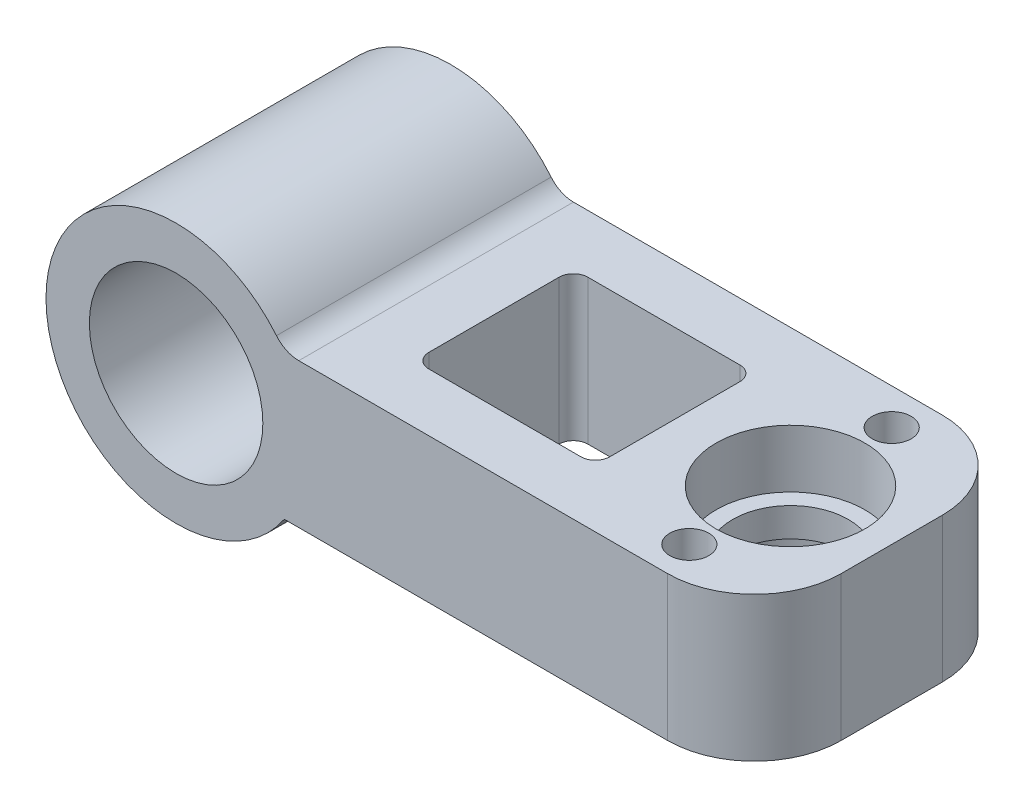
ISO-10303-21;
HEADER;
FILE_DESCRIPTION(('STEP AP214'),'2;1');
FILE_NAME('part.step','',(''),(''),'','','');
FILE_SCHEMA(('AUTOMOTIVE_DESIGN { 1 0 10303 214 1 1 1 1 }'));
ENDSEC;
DATA;
#1=APPLICATION_CONTEXT('core data for automotive mechanical design processes');
#2=APPLICATION_PROTOCOL_DEFINITION('international standard','automotive_design',2000,#1);
#3=PRODUCT_CONTEXT('',#1,'mechanical');
#4=PRODUCT('Part','Part','',(#3));
#5=PRODUCT_RELATED_PRODUCT_CATEGORY('part','',(#4));
#6=PRODUCT_DEFINITION_FORMATION('','',#4);
#7=PRODUCT_DEFINITION_CONTEXT('part definition',#1,'design');
#8=PRODUCT_DEFINITION('design','',#6,#7);
#9=PRODUCT_DEFINITION_SHAPE('','',#8);
#10=(LENGTH_UNIT() NAMED_UNIT(*) SI_UNIT(.MILLI.,.METRE.));
#11=(NAMED_UNIT(*) PLANE_ANGLE_UNIT() SI_UNIT($,.RADIAN.));
#12=(NAMED_UNIT(*) SI_UNIT($,.STERADIAN.) SOLID_ANGLE_UNIT());
#13=UNCERTAINTY_MEASURE_WITH_UNIT(LENGTH_MEASURE(1.E-05),#10,'distance_accuracy_value','');
#14=(GEOMETRIC_REPRESENTATION_CONTEXT(3) GLOBAL_UNCERTAINTY_ASSIGNED_CONTEXT((#13)) GLOBAL_UNIT_ASSIGNED_CONTEXT((#10,
#11,#12)) REPRESENTATION_CONTEXT('',''));
#15=CARTESIAN_POINT('',(0.,0.,0.));
#16=DIRECTION('',(0.,0.,1.));
#17=DIRECTION('',(1.,0.,0.));
#18=AXIS2_PLACEMENT_3D('',#15,#16,#17);
#19=CARTESIAN_POINT('',(33.,5.,0.));
#20=DIRECTION('',(0.,-1.,0.));
#21=DIRECTION('',(0.,0.,-1.));
#22=AXIS2_PLACEMENT_3D('',#19,#20,#21);
#23=CYLINDRICAL_SURFACE('',#22,4.);
#24=CARTESIAN_POINT('',(33.,1.,0.));
#25=DIRECTION('',(0.,1.,0.));
#26=DIRECTION('',(0.,0.,1.));
#27=AXIS2_PLACEMENT_3D('',#24,#25,#26);
#28=CIRCLE('',#27,4.);
#29=CARTESIAN_POINT('',(33.,1.,4.));
#30=VERTEX_POINT('',#29);
#31=EDGE_CURVE('E185',#30,#30,#28,.T.);
#32=ORIENTED_EDGE('',*,*,#31,.T.);
#33=EDGE_LOOP('',(#32));
#34=FACE_BOUND('',#33,.T.);
#35=CARTESIAN_POINT('',(33.,-1.,0.));
#36=DIRECTION('',(0.,-1.,0.));
#37=DIRECTION('',(0.,0.,-1.));
#38=AXIS2_PLACEMENT_3D('',#35,#36,#37);
#39=CIRCLE('',#38,4.);
#40=CARTESIAN_POINT('',(33.,-1.,-4.));
#41=VERTEX_POINT('',#40);
#42=EDGE_CURVE('E198',#41,#41,#39,.T.);
#43=ORIENTED_EDGE('',*,*,#42,.T.);
#44=EDGE_LOOP('',(#43));
#45=FACE_BOUND('',#44,.T.);
#46=ADVANCED_FACE('F33',(#34,#45),#23,.F.);
#47=CARTESIAN_POINT('',(0.,0.,9.5));
#48=DIRECTION('',(0.,0.,1.));
#49=DIRECTION('',(1.,0.,0.));
#50=AXIS2_PLACEMENT_3D('',#47,#48,#49);
#51=PLANE('',#50);
#52=CARTESIAN_POINT('',(0.,0.,9.5));
#53=DIRECTION('',(0.,0.,1.));
#54=DIRECTION('',(1.,0.,0.));
#55=AXIS2_PLACEMENT_3D('',#52,#53,#54);
#56=CIRCLE('',#55,6.);
#57=CARTESIAN_POINT('',(6.,0.,9.5));
#58=VERTEX_POINT('',#57);
#59=EDGE_CURVE('E179',#58,#58,#56,.T.);
#60=ORIENTED_EDGE('',*,*,#59,.F.);
#61=EDGE_LOOP('',(#60));
#62=FACE_BOUND('',#61,.T.);
#63=DIRECTION('',(1.,0.,0.));
#64=VECTOR('',#63,1.);
#65=CARTESIAN_POINT('',(0.,-5.,9.5));
#66=LINE('',#65,#64);
#67=CARTESIAN_POINT('',(7.48331477354788,-5.,9.5));
#68=VERTEX_POINT('',#67);
#69=CARTESIAN_POINT('',(34.,-5.,9.5));
#70=VERTEX_POINT('',#69);
#71=EDGE_CURVE('E144',#68,#70,#66,.T.);
#72=ORIENTED_EDGE('',*,*,#71,.T.);
#73=DIRECTION('',(0.,-1.,0.));
#74=VECTOR('',#73,1.);
#75=CARTESIAN_POINT('',(34.,5.,9.5));
#76=LINE('',#75,#74);
#77=CARTESIAN_POINT('',(34.,5.,9.5));
#78=VERTEX_POINT('',#77);
#79=EDGE_CURVE('E11',#70,#78,#76,.F.);
#80=ORIENTED_EDGE('',*,*,#79,.T.);
#81=DIRECTION('',(1.,0.,0.));
#82=VECTOR('',#81,1.);
#83=CARTESIAN_POINT('',(0.,5.,9.5));
#84=LINE('',#83,#82);
#85=CARTESIAN_POINT('',(8.48528137423857,5.,9.5));
#86=VERTEX_POINT('',#85);
#87=EDGE_CURVE('E177',#86,#78,#84,.T.);
#88=ORIENTED_EDGE('',*,*,#87,.F.);
#89=CARTESIAN_POINT('',(8.48528137423857,7.,9.5));
#90=DIRECTION('',(0.,0.,1.));
#91=DIRECTION('',(1.,0.,0.));
#92=AXIS2_PLACEMENT_3D('',#89,#90,#91);
#93=CIRCLE('',#92,2.);
#94=CARTESIAN_POINT('',(6.94250294255883,5.72727272727273,9.5));
#95=VERTEX_POINT('',#94);
#96=EDGE_CURVE('E146',#86,#95,#93,.F.);
#97=ORIENTED_EDGE('',*,*,#96,.T.);
#98=CARTESIAN_POINT('',(0.,0.,9.5));
#99=DIRECTION('',(0.,0.,1.));
#100=DIRECTION('',(1.,0.,0.));
#101=AXIS2_PLACEMENT_3D('',#98,#99,#100);
#102=CIRCLE('',#101,9.);
#103=EDGE_CURVE('E140',#95,#68,#102,.T.);
#104=ORIENTED_EDGE('',*,*,#103,.T.);
#105=EDGE_LOOP('',(#72,#80,#88,#97,#104));
#106=FACE_BOUND('',#105,.T.);
#107=ADVANCED_FACE('F142',(#62,#106),#51,.T.);
#108=CARTESIAN_POINT('',(0.,0.,-9.5));
#109=DIRECTION('',(0.,0.,1.));
#110=DIRECTION('',(1.,0.,0.));
#111=AXIS2_PLACEMENT_3D('',#108,#109,#110);
#112=PLANE('',#111);
#113=CARTESIAN_POINT('',(0.,0.,-9.5));
#114=DIRECTION('',(0.,0.,1.));
#115=DIRECTION('',(1.,0.,0.));
#116=AXIS2_PLACEMENT_3D('',#113,#114,#115);
#117=CIRCLE('',#116,6.);
#118=CARTESIAN_POINT('',(6.,0.,-9.5));
#119=VERTEX_POINT('',#118);
#120=EDGE_CURVE('E160',#119,#119,#117,.T.);
#121=ORIENTED_EDGE('',*,*,#120,.T.);
#122=EDGE_LOOP('',(#121));
#123=FACE_BOUND('',#122,.T.);
#124=DIRECTION('',(-1.,0.,0.));
#125=VECTOR('',#124,1.);
#126=CARTESIAN_POINT('',(0.,5.,-9.5));
#127=LINE('',#126,#125);
#128=CARTESIAN_POINT('',(34.,5.,-9.5));
#129=VERTEX_POINT('',#128);
#130=CARTESIAN_POINT('',(8.48528137423857,5.,-9.5));
#131=VERTEX_POINT('',#130);
#132=EDGE_CURVE('E161',#129,#131,#127,.T.);
#133=ORIENTED_EDGE('',*,*,#132,.F.);
#134=DIRECTION('',(0.,-1.,0.));
#135=VECTOR('',#134,1.);
#136=CARTESIAN_POINT('',(34.,0.,-9.5));
#137=LINE('',#136,#135);
#138=CARTESIAN_POINT('',(34.,-5.,-9.5));
#139=VERTEX_POINT('',#138);
#140=EDGE_CURVE('E250',#129,#139,#137,.T.);
#141=ORIENTED_EDGE('',*,*,#140,.T.);
#142=DIRECTION('',(-1.,0.,0.));
#143=VECTOR('',#142,1.);
#144=CARTESIAN_POINT('',(0.,-5.,-9.5));
#145=LINE('',#144,#143);
#146=CARTESIAN_POINT('',(7.48331477354788,-5.,-9.5));
#147=VERTEX_POINT('',#146);
#148=EDGE_CURVE('E169',#139,#147,#145,.T.);
#149=ORIENTED_EDGE('',*,*,#148,.T.);
#150=CARTESIAN_POINT('',(0.,0.,-9.5));
#151=DIRECTION('',(0.,0.,1.));
#152=DIRECTION('',(1.,0.,0.));
#153=AXIS2_PLACEMENT_3D('',#150,#151,#152);
#154=CIRCLE('',#153,9.);
#155=CARTESIAN_POINT('',(6.94250294255883,5.72727272727273,-9.5));
#156=VERTEX_POINT('',#155);
#157=EDGE_CURVE('E151',#156,#147,#154,.T.);
#158=ORIENTED_EDGE('',*,*,#157,.F.);
#159=CARTESIAN_POINT('',(8.48528137423857,7.,-9.5));
#160=DIRECTION('',(0.,0.,1.));
#161=DIRECTION('',(1.,0.,0.));
#162=AXIS2_PLACEMENT_3D('',#159,#160,#161);
#163=CIRCLE('',#162,2.);
#164=EDGE_CURVE('E193',#156,#131,#163,.T.);
#165=ORIENTED_EDGE('',*,*,#164,.T.);
#166=EDGE_LOOP('',(#133,#141,#149,#158,#165));
#167=FACE_BOUND('',#166,.T.);
#168=ADVANCED_FACE('F269',(#123,#167),#112,.F.);
#169=CARTESIAN_POINT('',(0.,0.,9.5));
#170=DIRECTION('',(0.,0.,-1.));
#171=DIRECTION('',(-1.,0.,0.));
#172=AXIS2_PLACEMENT_3D('',#169,#170,#171);
#173=CYLINDRICAL_SURFACE('',#172,9.);
#174=ORIENTED_EDGE('',*,*,#103,.F.);
#175=DIRECTION('',(0.,0.,-1.));
#176=VECTOR('',#175,1.);
#177=CARTESIAN_POINT('',(6.94250294255883,5.72727272727273,9.5));
#178=LINE('',#177,#176);
#179=EDGE_CURVE('E150',#95,#156,#178,.T.);
#180=ORIENTED_EDGE('',*,*,#179,.T.);
#181=ORIENTED_EDGE('',*,*,#157,.T.);
#182=DIRECTION('',(0.,0.,-1.));
#183=VECTOR('',#182,1.);
#184=CARTESIAN_POINT('',(7.48331477354788,-5.,9.5));
#185=LINE('',#184,#183);
#186=EDGE_CURVE('E155',#68,#147,#185,.T.);
#187=ORIENTED_EDGE('',*,*,#186,.F.);
#188=EDGE_LOOP('',(#174,#180,#181,#187));
#189=FACE_BOUND('',#188,.T.);
#190=ADVANCED_FACE('F156',(#189),#173,.T.);
#191=CARTESIAN_POINT('',(0.,0.,9.5));
#192=DIRECTION('',(0.,0.,-1.));
#193=DIRECTION('',(-1.,0.,0.));
#194=AXIS2_PLACEMENT_3D('',#191,#192,#193);
#195=CYLINDRICAL_SURFACE('',#194,6.);
#196=ORIENTED_EDGE('',*,*,#120,.F.);
#197=EDGE_LOOP('',(#196));
#198=FACE_BOUND('',#197,.T.);
#199=ORIENTED_EDGE('',*,*,#59,.T.);
#200=EDGE_LOOP('',(#199));
#201=FACE_BOUND('',#200,.T.);
#202=ADVANCED_FACE('F346',(#198,#201),#195,.F.);
#203=CARTESIAN_POINT('',(0.,5.,0.));
#204=DIRECTION('',(0.,1.,0.));
#205=DIRECTION('',(0.,0.,1.));
#206=AXIS2_PLACEMENT_3D('',#203,#204,#205);
#207=PLANE('',#206);
#208=DIRECTION('',(0.,0.,1.));
#209=VECTOR('',#208,1.);
#210=CARTESIAN_POINT('',(12.4852813742386,5.,-5.5));
#211=LINE('',#210,#209);
#212=CARTESIAN_POINT('',(12.4852813742386,5.,-4.5));
#213=VERTEX_POINT('',#212);
#214=CARTESIAN_POINT('',(12.4852813742386,5.,4.5));
#215=VERTEX_POINT('',#214);
#216=EDGE_CURVE('E303',#213,#215,#211,.T.);
#217=ORIENTED_EDGE('',*,*,#216,.F.);
#218=CARTESIAN_POINT('',(13.4852813742386,5.,-4.5));
#219=DIRECTION('',(0.,1.,0.));
#220=DIRECTION('',(0.,0.,1.));
#221=AXIS2_PLACEMENT_3D('',#218,#219,#220);
#222=CIRCLE('',#221,1.);
#223=CARTESIAN_POINT('',(13.4852813742386,5.,-5.5));
#224=VERTEX_POINT('',#223);
#225=EDGE_CURVE('E246',#213,#224,#222,.F.);
#226=ORIENTED_EDGE('',*,*,#225,.T.);
#227=DIRECTION('',(-1.,0.,0.));
#228=VECTOR('',#227,1.);
#229=CARTESIAN_POINT('',(12.4852813742386,5.,-5.5));
#230=LINE('',#229,#228);
#231=CARTESIAN_POINT('',(24.,5.,-5.5));
#232=VERTEX_POINT('',#231);
#233=EDGE_CURVE('E292',#232,#224,#230,.T.);
#234=ORIENTED_EDGE('',*,*,#233,.F.);
#235=CARTESIAN_POINT('',(24.,5.,-4.5));
#236=DIRECTION('',(0.,1.,0.));
#237=DIRECTION('',(0.,0.,1.));
#238=AXIS2_PLACEMENT_3D('',#235,#236,#237);
#239=CIRCLE('',#238,1.);
#240=CARTESIAN_POINT('',(25.,5.,-4.5));
#241=VERTEX_POINT('',#240);
#242=EDGE_CURVE('E242',#232,#241,#239,.F.);
#243=ORIENTED_EDGE('',*,*,#242,.T.);
#244=DIRECTION('',(0.,0.,-1.));
#245=VECTOR('',#244,1.);
#246=CARTESIAN_POINT('',(25.,5.,-5.5));
#247=LINE('',#246,#245);
#248=CARTESIAN_POINT('',(25.,5.,4.5));
#249=VERTEX_POINT('',#248);
#250=EDGE_CURVE('E297',#249,#241,#247,.T.);
#251=ORIENTED_EDGE('',*,*,#250,.F.);
#252=CARTESIAN_POINT('',(24.,5.,4.5));
#253=DIRECTION('',(0.,1.,0.));
#254=DIRECTION('',(0.,0.,1.));
#255=AXIS2_PLACEMENT_3D('',#252,#253,#254);
#256=CIRCLE('',#255,1.);
#257=CARTESIAN_POINT('',(24.,5.,5.5));
#258=VERTEX_POINT('',#257);
#259=EDGE_CURVE('E234',#249,#258,#256,.F.);
#260=ORIENTED_EDGE('',*,*,#259,.T.);
#261=DIRECTION('',(1.,0.,0.));
#262=VECTOR('',#261,1.);
#263=CARTESIAN_POINT('',(12.4852813742386,5.,5.5));
#264=LINE('',#263,#262);
#265=CARTESIAN_POINT('',(13.4852813742386,5.,5.5));
#266=VERTEX_POINT('',#265);
#267=EDGE_CURVE('E300',#266,#258,#264,.T.);
#268=ORIENTED_EDGE('',*,*,#267,.F.);
#269=CARTESIAN_POINT('',(13.4852813742386,5.,4.5));
#270=DIRECTION('',(0.,1.,0.));
#271=DIRECTION('',(0.,0.,1.));
#272=AXIS2_PLACEMENT_3D('',#269,#270,#271);
#273=CIRCLE('',#272,1.);
#274=EDGE_CURVE('E238',#266,#215,#273,.F.);
#275=ORIENTED_EDGE('',*,*,#274,.T.);
#276=EDGE_LOOP('',(#217,#226,#234,#243,#251,#260,#268,#275));
#277=FACE_BOUND('',#276,.T.);
#278=CARTESIAN_POINT('',(33.,5.,0.));
#279=DIRECTION('',(0.,1.,0.));
#280=DIRECTION('',(0.,0.,1.));
#281=AXIS2_PLACEMENT_3D('',#278,#279,#280);
#282=CIRCLE('',#281,5.15);
#283=CARTESIAN_POINT('',(33.,5.,5.15));
#284=VERTEX_POINT('',#283);
#285=EDGE_CURVE('E201',#284,#284,#282,.T.);
#286=ORIENTED_EDGE('',*,*,#285,.F.);
#287=EDGE_LOOP('',(#286));
#288=FACE_BOUND('',#287,.T.);
#289=CARTESIAN_POINT('',(33.,5.,7.));
#290=DIRECTION('',(0.,1.,0.));
#291=DIRECTION('',(0.,0.,1.));
#292=AXIS2_PLACEMENT_3D('',#289,#290,#291);
#293=CIRCLE('',#292,1.35);
#294=CARTESIAN_POINT('',(33.,5.,8.35));
#295=VERTEX_POINT('',#294);
#296=EDGE_CURVE('E167',#295,#295,#293,.T.);
#297=ORIENTED_EDGE('',*,*,#296,.F.);
#298=EDGE_LOOP('',(#297));
#299=FACE_BOUND('',#298,.T.);
#300=CARTESIAN_POINT('',(33.,5.,-7.));
#301=DIRECTION('',(0.,1.,0.));
#302=DIRECTION('',(0.,0.,1.));
#303=AXIS2_PLACEMENT_3D('',#300,#301,#302);
#304=CIRCLE('',#303,1.35);
#305=CARTESIAN_POINT('',(33.,5.,-5.65));
#306=VERTEX_POINT('',#305);
#307=EDGE_CURVE('E279',#306,#306,#304,.T.);
#308=ORIENTED_EDGE('',*,*,#307,.F.);
#309=EDGE_LOOP('',(#308));
#310=FACE_BOUND('',#309,.T.);
#311=DIRECTION('',(0.,0.,-1.));
#312=VECTOR('',#311,1.);
#313=CARTESIAN_POINT('',(40.,5.,-9.5));
#314=LINE('',#313,#312);
#315=CARTESIAN_POINT('',(40.,5.,3.5));
#316=VERTEX_POINT('',#315);
#317=CARTESIAN_POINT('',(40.,5.,-3.5));
#318=VERTEX_POINT('',#317);
#319=EDGE_CURVE('E265',#316,#318,#314,.T.);
#320=ORIENTED_EDGE('',*,*,#319,.T.);
#321=CARTESIAN_POINT('',(34.,5.,-3.5));
#322=DIRECTION('',(0.,1.,0.));
#323=DIRECTION('',(0.,0.,1.));
#324=AXIS2_PLACEMENT_3D('',#321,#322,#323);
#325=CIRCLE('',#324,6.);
#326=EDGE_CURVE('E41',#318,#129,#325,.T.);
#327=ORIENTED_EDGE('',*,*,#326,.T.);
#328=ORIENTED_EDGE('',*,*,#132,.T.);
#329=DIRECTION('',(0.,0.,-1.));
#330=VECTOR('',#329,1.);
#331=CARTESIAN_POINT('',(8.48528137423857,5.,0.));
#332=LINE('',#331,#330);
#333=EDGE_CURVE('E191',#131,#86,#332,.F.);
#334=ORIENTED_EDGE('',*,*,#333,.T.);
#335=ORIENTED_EDGE('',*,*,#87,.T.);
#336=CARTESIAN_POINT('',(34.,5.,3.5));
#337=DIRECTION('',(0.,1.,0.));
#338=DIRECTION('',(0.,0.,1.));
#339=AXIS2_PLACEMENT_3D('',#336,#337,#338);
#340=CIRCLE('',#339,6.);
#341=EDGE_CURVE('E260',#78,#316,#340,.T.);
#342=ORIENTED_EDGE('',*,*,#341,.T.);
#343=EDGE_LOOP('',(#320,#327,#328,#334,#335,#342));
#344=FACE_BOUND('',#343,.T.);
#345=ADVANCED_FACE('F264',(#277,#288,#299,#310,#344),#207,.T.);
#346=CARTESIAN_POINT('',(0.,-5.,0.));
#347=DIRECTION('',(0.,1.,0.));
#348=DIRECTION('',(0.,0.,1.));
#349=AXIS2_PLACEMENT_3D('',#346,#347,#348);
#350=PLANE('',#349);
#351=DIRECTION('',(0.,0.,-1.));
#352=VECTOR('',#351,1.);
#353=CARTESIAN_POINT('',(25.,-5.,0.));
#354=LINE('',#353,#352);
#355=CARTESIAN_POINT('',(25.,-5.,4.5));
#356=VERTEX_POINT('',#355);
#357=CARTESIAN_POINT('',(25.,-5.,-4.5));
#358=VERTEX_POINT('',#357);
#359=EDGE_CURVE('E205',#356,#358,#354,.T.);
#360=ORIENTED_EDGE('',*,*,#359,.T.);
#361=CARTESIAN_POINT('',(24.,-5.,-4.5));
#362=DIRECTION('',(0.,1.,0.));
#363=DIRECTION('',(0.,0.,1.));
#364=AXIS2_PLACEMENT_3D('',#361,#362,#363);
#365=CIRCLE('',#364,1.);
#366=CARTESIAN_POINT('',(24.,-5.,-5.5));
#367=VERTEX_POINT('',#366);
#368=EDGE_CURVE('E244',#358,#367,#365,.T.);
#369=ORIENTED_EDGE('',*,*,#368,.T.);
#370=DIRECTION('',(-1.,0.,0.));
#371=VECTOR('',#370,1.);
#372=CARTESIAN_POINT('',(0.,-5.,-5.5));
#373=LINE('',#372,#371);
#374=CARTESIAN_POINT('',(13.4852813742386,-5.,-5.5));
#375=VERTEX_POINT('',#374);
#376=EDGE_CURVE('E208',#367,#375,#373,.T.);
#377=ORIENTED_EDGE('',*,*,#376,.T.);
#378=CARTESIAN_POINT('',(13.4852813742386,-5.,-4.5));
#379=DIRECTION('',(0.,1.,0.));
#380=DIRECTION('',(0.,0.,1.));
#381=AXIS2_PLACEMENT_3D('',#378,#379,#380);
#382=CIRCLE('',#381,1.);
#383=CARTESIAN_POINT('',(12.4852813742386,-5.,-4.5));
#384=VERTEX_POINT('',#383);
#385=EDGE_CURVE('E248',#375,#384,#382,.T.);
#386=ORIENTED_EDGE('',*,*,#385,.T.);
#387=DIRECTION('',(0.,0.,1.));
#388=VECTOR('',#387,1.);
#389=CARTESIAN_POINT('',(12.4852813742386,-5.,0.));
#390=LINE('',#389,#388);
#391=CARTESIAN_POINT('',(12.4852813742386,-5.,4.5));
#392=VERTEX_POINT('',#391);
#393=EDGE_CURVE('E211',#384,#392,#390,.T.);
#394=ORIENTED_EDGE('',*,*,#393,.T.);
#395=CARTESIAN_POINT('',(13.4852813742386,-5.,4.5));
#396=DIRECTION('',(0.,1.,0.));
#397=DIRECTION('',(0.,0.,1.));
#398=AXIS2_PLACEMENT_3D('',#395,#396,#397);
#399=CIRCLE('',#398,1.);
#400=CARTESIAN_POINT('',(13.4852813742386,-5.,5.5));
#401=VERTEX_POINT('',#400);
#402=EDGE_CURVE('E240',#392,#401,#399,.T.);
#403=ORIENTED_EDGE('',*,*,#402,.T.);
#404=DIRECTION('',(1.,0.,0.));
#405=VECTOR('',#404,1.);
#406=CARTESIAN_POINT('',(0.,-5.,5.5));
#407=LINE('',#406,#405);
#408=CARTESIAN_POINT('',(24.,-5.,5.5));
#409=VERTEX_POINT('',#408);
#410=EDGE_CURVE('E197',#401,#409,#407,.T.);
#411=ORIENTED_EDGE('',*,*,#410,.T.);
#412=CARTESIAN_POINT('',(24.,-5.,4.5));
#413=DIRECTION('',(0.,1.,0.));
#414=DIRECTION('',(0.,0.,1.));
#415=AXIS2_PLACEMENT_3D('',#412,#413,#414);
#416=CIRCLE('',#415,1.);
#417=EDGE_CURVE('E236',#409,#356,#416,.T.);
#418=ORIENTED_EDGE('',*,*,#417,.T.);
#419=EDGE_LOOP('',(#360,#369,#377,#386,#394,#403,#411,#418));
#420=FACE_BOUND('',#419,.T.);
#421=CARTESIAN_POINT('',(33.,-5.,0.));
#422=DIRECTION('',(0.,1.,0.));
#423=DIRECTION('',(0.,0.,1.));
#424=AXIS2_PLACEMENT_3D('',#421,#422,#423);
#425=CIRCLE('',#424,5.15);
#426=CARTESIAN_POINT('',(33.,-5.,5.15));
#427=VERTEX_POINT('',#426);
#428=EDGE_CURVE('E289',#427,#427,#425,.T.);
#429=ORIENTED_EDGE('',*,*,#428,.T.);
#430=EDGE_LOOP('',(#429));
#431=FACE_BOUND('',#430,.T.);
#432=CARTESIAN_POINT('',(33.,-5.,7.));
#433=DIRECTION('',(0.,1.,0.));
#434=DIRECTION('',(0.,0.,1.));
#435=AXIS2_PLACEMENT_3D('',#432,#433,#434);
#436=CIRCLE('',#435,1.35);
#437=CARTESIAN_POINT('',(33.,-5.,8.35));
#438=VERTEX_POINT('',#437);
#439=EDGE_CURVE('E172',#438,#438,#436,.T.);
#440=ORIENTED_EDGE('',*,*,#439,.T.);
#441=EDGE_LOOP('',(#440));
#442=FACE_BOUND('',#441,.T.);
#443=CARTESIAN_POINT('',(33.,-5.,-7.));
#444=DIRECTION('',(0.,1.,0.));
#445=DIRECTION('',(0.,0.,1.));
#446=AXIS2_PLACEMENT_3D('',#443,#444,#445);
#447=CIRCLE('',#446,1.35);
#448=CARTESIAN_POINT('',(33.,-5.,-5.65));
#449=VERTEX_POINT('',#448);
#450=EDGE_CURVE('E188',#449,#449,#447,.T.);
#451=ORIENTED_EDGE('',*,*,#450,.T.);
#452=EDGE_LOOP('',(#451));
#453=FACE_BOUND('',#452,.T.);
#454=ORIENTED_EDGE('',*,*,#148,.F.);
#455=CARTESIAN_POINT('',(34.,-5.,-3.5));
#456=DIRECTION('',(0.,1.,0.));
#457=DIRECTION('',(0.,0.,1.));
#458=AXIS2_PLACEMENT_3D('',#455,#456,#457);
#459=CIRCLE('',#458,6.);
#460=CARTESIAN_POINT('',(40.,-5.,-3.5));
#461=VERTEX_POINT('',#460);
#462=EDGE_CURVE('E254',#139,#461,#459,.F.);
#463=ORIENTED_EDGE('',*,*,#462,.T.);
#464=DIRECTION('',(0.,0.,-1.));
#465=VECTOR('',#464,1.);
#466=CARTESIAN_POINT('',(40.,-5.,-9.5));
#467=LINE('',#466,#465);
#468=CARTESIAN_POINT('',(40.,-5.,3.5));
#469=VERTEX_POINT('',#468);
#470=EDGE_CURVE('E166',#469,#461,#467,.T.);
#471=ORIENTED_EDGE('',*,*,#470,.F.);
#472=CARTESIAN_POINT('',(34.,-5.,3.5));
#473=DIRECTION('',(0.,1.,0.));
#474=DIRECTION('',(0.,0.,1.));
#475=AXIS2_PLACEMENT_3D('',#472,#473,#474);
#476=CIRCLE('',#475,6.);
#477=EDGE_CURVE('E165',#469,#70,#476,.F.);
#478=ORIENTED_EDGE('',*,*,#477,.T.);
#479=ORIENTED_EDGE('',*,*,#71,.F.);
#480=ORIENTED_EDGE('',*,*,#186,.T.);
#481=EDGE_LOOP('',(#454,#463,#471,#478,#479,#480));
#482=FACE_BOUND('',#481,.T.);
#483=ADVANCED_FACE('F163',(#420,#431,#442,#453,#482),#350,.F.);
#484=CARTESIAN_POINT('',(40.,5.,-9.5));
#485=DIRECTION('',(-1.,0.,0.));
#486=DIRECTION('',(0.,0.,1.));
#487=AXIS2_PLACEMENT_3D('',#484,#485,#486);
#488=PLANE('',#487);
#489=ORIENTED_EDGE('',*,*,#470,.T.);
#490=DIRECTION('',(0.,-1.,0.));
#491=VECTOR('',#490,1.);
#492=CARTESIAN_POINT('',(40.,5.,-3.5));
#493=LINE('',#492,#491);
#494=EDGE_CURVE('E54',#461,#318,#493,.F.);
#495=ORIENTED_EDGE('',*,*,#494,.T.);
#496=ORIENTED_EDGE('',*,*,#319,.F.);
#497=DIRECTION('',(0.,-1.,0.));
#498=VECTOR('',#497,1.);
#499=CARTESIAN_POINT('',(40.,-5.,3.5));
#500=LINE('',#499,#498);
#501=EDGE_CURVE('E256',#316,#469,#500,.T.);
#502=ORIENTED_EDGE('',*,*,#501,.T.);
#503=EDGE_LOOP('',(#489,#495,#496,#502));
#504=FACE_BOUND('',#503,.T.);
#505=ADVANCED_FACE('F272',(#504),#488,.F.);
#506=CARTESIAN_POINT('',(33.,5.,7.));
#507=DIRECTION('',(0.,-1.,0.));
#508=DIRECTION('',(0.,0.,-1.));
#509=AXIS2_PLACEMENT_3D('',#506,#507,#508);
#510=CYLINDRICAL_SURFACE('',#509,1.35);
#511=ORIENTED_EDGE('',*,*,#296,.T.);
#512=EDGE_LOOP('',(#511));
#513=FACE_BOUND('',#512,.T.);
#514=ORIENTED_EDGE('',*,*,#439,.F.);
#515=EDGE_LOOP('',(#514));
#516=FACE_BOUND('',#515,.T.);
#517=ADVANCED_FACE('F358',(#513,#516),#510,.F.);
#518=CARTESIAN_POINT('',(33.,5.,-7.));
#519=DIRECTION('',(0.,-1.,0.));
#520=DIRECTION('',(0.,0.,-1.));
#521=AXIS2_PLACEMENT_3D('',#518,#519,#520);
#522=CYLINDRICAL_SURFACE('',#521,1.35);
#523=ORIENTED_EDGE('',*,*,#307,.T.);
#524=EDGE_LOOP('',(#523));
#525=FACE_BOUND('',#524,.T.);
#526=ORIENTED_EDGE('',*,*,#450,.F.);
#527=EDGE_LOOP('',(#526));
#528=FACE_BOUND('',#527,.T.);
#529=ADVANCED_FACE('F354',(#525,#528),#522,.F.);
#530=CARTESIAN_POINT('',(33.,1.,0.));
#531=DIRECTION('',(0.,1.,0.));
#532=DIRECTION('',(0.,0.,1.));
#533=AXIS2_PLACEMENT_3D('',#530,#531,#532);
#534=CYLINDRICAL_SURFACE('',#533,5.15);
#535=CARTESIAN_POINT('',(33.,1.,0.));
#536=DIRECTION('',(0.,1.,0.));
#537=DIRECTION('',(0.,0.,1.));
#538=AXIS2_PLACEMENT_3D('',#535,#536,#537);
#539=CIRCLE('',#538,5.15);
#540=CARTESIAN_POINT('',(33.,1.,5.15));
#541=VERTEX_POINT('',#540);
#542=EDGE_CURVE('E189',#541,#541,#539,.T.);
#543=ORIENTED_EDGE('',*,*,#542,.F.);
#544=EDGE_LOOP('',(#543));
#545=FACE_BOUND('',#544,.T.);
#546=ORIENTED_EDGE('',*,*,#285,.T.);
#547=EDGE_LOOP('',(#546));
#548=FACE_BOUND('',#547,.T.);
#549=ADVANCED_FACE('F357',(#545,#548),#534,.F.);
#550=CARTESIAN_POINT('',(33.,1.,0.));
#551=DIRECTION('',(0.,1.,0.));
#552=DIRECTION('',(0.,0.,1.));
#553=AXIS2_PLACEMENT_3D('',#550,#551,#552);
#554=PLANE('',#553);
#555=ORIENTED_EDGE('',*,*,#31,.F.);
#556=EDGE_LOOP('',(#555));
#557=FACE_BOUND('',#556,.T.);
#558=ORIENTED_EDGE('',*,*,#542,.T.);
#559=EDGE_LOOP('',(#558));
#560=FACE_BOUND('',#559,.T.);
#561=ADVANCED_FACE('F400',(#557,#560),#554,.T.);
#562=CARTESIAN_POINT('',(8.48528137423857,7.,9.5));
#563=DIRECTION('',(0.,0.,-1.));
#564=DIRECTION('',(-1.,0.,0.));
#565=AXIS2_PLACEMENT_3D('',#562,#563,#564);
#566=CYLINDRICAL_SURFACE('',#565,2.);
#567=ORIENTED_EDGE('',*,*,#96,.F.);
#568=ORIENTED_EDGE('',*,*,#333,.F.);
#569=ORIENTED_EDGE('',*,*,#164,.F.);
#570=ORIENTED_EDGE('',*,*,#179,.F.);
#571=EDGE_LOOP('',(#567,#568,#569,#570));
#572=FACE_BOUND('',#571,.T.);
#573=ADVANCED_FACE('F407',(#572),#566,.F.);
#574=CARTESIAN_POINT('',(33.,-1.,0.));
#575=DIRECTION('',(0.,-1.,0.));
#576=DIRECTION('',(0.,0.,-1.));
#577=AXIS2_PLACEMENT_3D('',#574,#575,#576);
#578=CYLINDRICAL_SURFACE('',#577,5.15);
#579=CARTESIAN_POINT('',(33.,-1.,0.));
#580=DIRECTION('',(0.,1.,0.));
#581=DIRECTION('',(0.,0.,1.));
#582=AXIS2_PLACEMENT_3D('',#579,#580,#581);
#583=CIRCLE('',#582,5.15);
#584=CARTESIAN_POINT('',(33.,-1.,5.15));
#585=VERTEX_POINT('',#584);
#586=EDGE_CURVE('E202',#585,#585,#583,.T.);
#587=ORIENTED_EDGE('',*,*,#586,.T.);
#588=EDGE_LOOP('',(#587));
#589=FACE_BOUND('',#588,.T.);
#590=ORIENTED_EDGE('',*,*,#428,.F.);
#591=EDGE_LOOP('',(#590));
#592=FACE_BOUND('',#591,.T.);
#593=ADVANCED_FACE('F416',(#589,#592),#578,.F.);
#594=CARTESIAN_POINT('',(33.,-1.,0.));
#595=DIRECTION('',(0.,-1.,0.));
#596=DIRECTION('',(0.,0.,1.));
#597=AXIS2_PLACEMENT_3D('',#594,#595,#596);
#598=PLANE('',#597);
#599=ORIENTED_EDGE('',*,*,#42,.F.);
#600=EDGE_LOOP('',(#599));
#601=FACE_BOUND('',#600,.T.);
#602=ORIENTED_EDGE('',*,*,#586,.F.);
#603=EDGE_LOOP('',(#602));
#604=FACE_BOUND('',#603,.T.);
#605=ADVANCED_FACE('F425',(#601,#604),#598,.T.);
#606=CARTESIAN_POINT('',(12.4852813742386,-9.,-5.5));
#607=DIRECTION('',(-1.,0.,0.));
#608=DIRECTION('',(0.,0.,1.));
#609=AXIS2_PLACEMENT_3D('',#606,#607,#608);
#610=PLANE('',#609);
#611=ORIENTED_EDGE('',*,*,#216,.T.);
#612=DIRECTION('',(0.,1.,0.));
#613=VECTOR('',#612,1.);
#614=CARTESIAN_POINT('',(12.4852813742386,-5.,4.5));
#615=LINE('',#614,#613);
#616=EDGE_CURVE('E227',#215,#392,#615,.F.);
#617=ORIENTED_EDGE('',*,*,#616,.T.);
#618=ORIENTED_EDGE('',*,*,#393,.F.);
#619=DIRECTION('',(0.,1.,0.));
#620=VECTOR('',#619,1.);
#621=CARTESIAN_POINT('',(12.4852813742386,5.,-4.5));
#622=LINE('',#621,#620);
#623=EDGE_CURVE('E224',#384,#213,#622,.T.);
#624=ORIENTED_EDGE('',*,*,#623,.T.);
#625=EDGE_LOOP('',(#611,#617,#618,#624));
#626=FACE_BOUND('',#625,.T.);
#627=ADVANCED_FACE('F308',(#626),#610,.F.);
#628=CARTESIAN_POINT('',(12.4852813742386,-9.,-5.5));
#629=DIRECTION('',(0.,0.,-1.));
#630=DIRECTION('',(-1.,0.,0.));
#631=AXIS2_PLACEMENT_3D('',#628,#629,#630);
#632=PLANE('',#631);
#633=ORIENTED_EDGE('',*,*,#376,.F.);
#634=DIRECTION('',(0.,1.,0.));
#635=VECTOR('',#634,1.);
#636=CARTESIAN_POINT('',(24.,5.,-5.5));
#637=LINE('',#636,#635);
#638=EDGE_CURVE('E231',#367,#232,#637,.T.);
#639=ORIENTED_EDGE('',*,*,#638,.T.);
#640=ORIENTED_EDGE('',*,*,#233,.T.);
#641=DIRECTION('',(0.,1.,0.));
#642=VECTOR('',#641,1.);
#643=CARTESIAN_POINT('',(13.4852813742386,-5.,-5.5));
#644=LINE('',#643,#642);
#645=EDGE_CURVE('E229',#224,#375,#644,.F.);
#646=ORIENTED_EDGE('',*,*,#645,.T.);
#647=EDGE_LOOP('',(#633,#639,#640,#646));
#648=FACE_BOUND('',#647,.T.);
#649=ADVANCED_FACE('F339',(#648),#632,.F.);
#650=CARTESIAN_POINT('',(25.,-9.,-5.5));
#651=DIRECTION('',(1.,0.,0.));
#652=DIRECTION('',(0.,0.,-1.));
#653=AXIS2_PLACEMENT_3D('',#650,#651,#652);
#654=PLANE('',#653);
#655=ORIENTED_EDGE('',*,*,#359,.F.);
#656=DIRECTION('',(0.,1.,0.));
#657=VECTOR('',#656,1.);
#658=CARTESIAN_POINT('',(25.,5.,4.5));
#659=LINE('',#658,#657);
#660=EDGE_CURVE('E216',#356,#249,#659,.T.);
#661=ORIENTED_EDGE('',*,*,#660,.T.);
#662=ORIENTED_EDGE('',*,*,#250,.T.);
#663=DIRECTION('',(0.,1.,0.));
#664=VECTOR('',#663,1.);
#665=CARTESIAN_POINT('',(25.,-5.,-4.5));
#666=LINE('',#665,#664);
#667=EDGE_CURVE('E214',#241,#358,#666,.F.);
#668=ORIENTED_EDGE('',*,*,#667,.T.);
#669=EDGE_LOOP('',(#655,#661,#662,#668));
#670=FACE_BOUND('',#669,.T.);
#671=ADVANCED_FACE('F330',(#670),#654,.F.);
#672=CARTESIAN_POINT('',(12.4852813742386,-9.,5.5));
#673=DIRECTION('',(0.,0.,1.));
#674=DIRECTION('',(1.,0.,0.));
#675=AXIS2_PLACEMENT_3D('',#672,#673,#674);
#676=PLANE('',#675);
#677=ORIENTED_EDGE('',*,*,#267,.T.);
#678=DIRECTION('',(0.,1.,0.));
#679=VECTOR('',#678,1.);
#680=CARTESIAN_POINT('',(24.,-5.,5.5));
#681=LINE('',#680,#679);
#682=EDGE_CURVE('E222',#258,#409,#681,.F.);
#683=ORIENTED_EDGE('',*,*,#682,.T.);
#684=ORIENTED_EDGE('',*,*,#410,.F.);
#685=DIRECTION('',(0.,1.,0.));
#686=VECTOR('',#685,1.);
#687=CARTESIAN_POINT('',(13.4852813742386,5.,5.5));
#688=LINE('',#687,#686);
#689=EDGE_CURVE('E219',#401,#266,#688,.T.);
#690=ORIENTED_EDGE('',*,*,#689,.T.);
#691=EDGE_LOOP('',(#677,#683,#684,#690));
#692=FACE_BOUND('',#691,.T.);
#693=ADVANCED_FACE('F321',(#692),#676,.F.);
#694=CARTESIAN_POINT('',(24.,-9.,4.5));
#695=DIRECTION('',(0.,-1.,0.));
#696=DIRECTION('',(0.,0.,-1.));
#697=AXIS2_PLACEMENT_3D('',#694,#695,#696);
#698=CYLINDRICAL_SURFACE('',#697,1.);
#699=ORIENTED_EDGE('',*,*,#417,.F.);
#700=ORIENTED_EDGE('',*,*,#682,.F.);
#701=ORIENTED_EDGE('',*,*,#259,.F.);
#702=ORIENTED_EDGE('',*,*,#660,.F.);
#703=EDGE_LOOP('',(#699,#700,#701,#702));
#704=FACE_BOUND('',#703,.T.);
#705=ADVANCED_FACE('F325',(#704),#698,.F.);
#706=CARTESIAN_POINT('',(13.4852813742386,-9.,4.5));
#707=DIRECTION('',(0.,-1.,0.));
#708=DIRECTION('',(0.,0.,-1.));
#709=AXIS2_PLACEMENT_3D('',#706,#707,#708);
#710=CYLINDRICAL_SURFACE('',#709,1.);
#711=ORIENTED_EDGE('',*,*,#402,.F.);
#712=ORIENTED_EDGE('',*,*,#616,.F.);
#713=ORIENTED_EDGE('',*,*,#274,.F.);
#714=ORIENTED_EDGE('',*,*,#689,.F.);
#715=EDGE_LOOP('',(#711,#712,#713,#714));
#716=FACE_BOUND('',#715,.T.);
#717=ADVANCED_FACE('F314',(#716),#710,.F.);
#718=CARTESIAN_POINT('',(24.,-9.,-4.5));
#719=DIRECTION('',(0.,-1.,0.));
#720=DIRECTION('',(0.,0.,-1.));
#721=AXIS2_PLACEMENT_3D('',#718,#719,#720);
#722=CYLINDRICAL_SURFACE('',#721,1.);
#723=ORIENTED_EDGE('',*,*,#368,.F.);
#724=ORIENTED_EDGE('',*,*,#667,.F.);
#725=ORIENTED_EDGE('',*,*,#242,.F.);
#726=ORIENTED_EDGE('',*,*,#638,.F.);
#727=EDGE_LOOP('',(#723,#724,#725,#726));
#728=FACE_BOUND('',#727,.T.);
#729=ADVANCED_FACE('F334',(#728),#722,.F.);
#730=CARTESIAN_POINT('',(13.4852813742386,-9.,-4.5));
#731=DIRECTION('',(0.,-1.,0.));
#732=DIRECTION('',(0.,0.,-1.));
#733=AXIS2_PLACEMENT_3D('',#730,#731,#732);
#734=CYLINDRICAL_SURFACE('',#733,1.);
#735=ORIENTED_EDGE('',*,*,#385,.F.);
#736=ORIENTED_EDGE('',*,*,#645,.F.);
#737=ORIENTED_EDGE('',*,*,#225,.F.);
#738=ORIENTED_EDGE('',*,*,#623,.F.);
#739=EDGE_LOOP('',(#735,#736,#737,#738));
#740=FACE_BOUND('',#739,.T.);
#741=ADVANCED_FACE('F343',(#740),#734,.F.);
#742=CARTESIAN_POINT('',(34.,0.,-3.5));
#743=DIRECTION('',(0.,-1.,0.));
#744=DIRECTION('',(0.,0.,-1.));
#745=AXIS2_PLACEMENT_3D('',#742,#743,#744);
#746=CYLINDRICAL_SURFACE('',#745,6.);
#747=ORIENTED_EDGE('',*,*,#326,.F.);
#748=ORIENTED_EDGE('',*,*,#494,.F.);
#749=ORIENTED_EDGE('',*,*,#462,.F.);
#750=ORIENTED_EDGE('',*,*,#140,.F.);
#751=EDGE_LOOP('',(#747,#748,#749,#750));
#752=FACE_BOUND('',#751,.T.);
#753=ADVANCED_FACE('F271',(#752),#746,.T.);
#754=CARTESIAN_POINT('',(34.,5.,3.5));
#755=DIRECTION('',(0.,1.,0.));
#756=DIRECTION('',(0.,0.,1.));
#757=AXIS2_PLACEMENT_3D('',#754,#755,#756);
#758=CYLINDRICAL_SURFACE('',#757,6.);
#759=ORIENTED_EDGE('',*,*,#341,.F.);
#760=ORIENTED_EDGE('',*,*,#79,.F.);
#761=ORIENTED_EDGE('',*,*,#477,.F.);
#762=ORIENTED_EDGE('',*,*,#501,.F.);
#763=EDGE_LOOP('',(#759,#760,#761,#762));
#764=FACE_BOUND('',#763,.T.);
#765=ADVANCED_FACE('F35',(#764),#758,.T.);
#766=CLOSED_SHELL('',(#46,#107,#168,#190,#202,#345,#483,#505,#517,#529,#549,#561,#573,#593,#605,
#627,#649,#671,#693,#705,#717,#729,#741,#753,#765));
#767=MANIFOLD_SOLID_BREP('B2',#766);
#768=ADVANCED_BREP_SHAPE_REPRESENTATION('',(#18,#767),#14);
#769=SHAPE_DEFINITION_REPRESENTATION(#9,#768);
ENDSEC;
END-ISO-10303-21;
